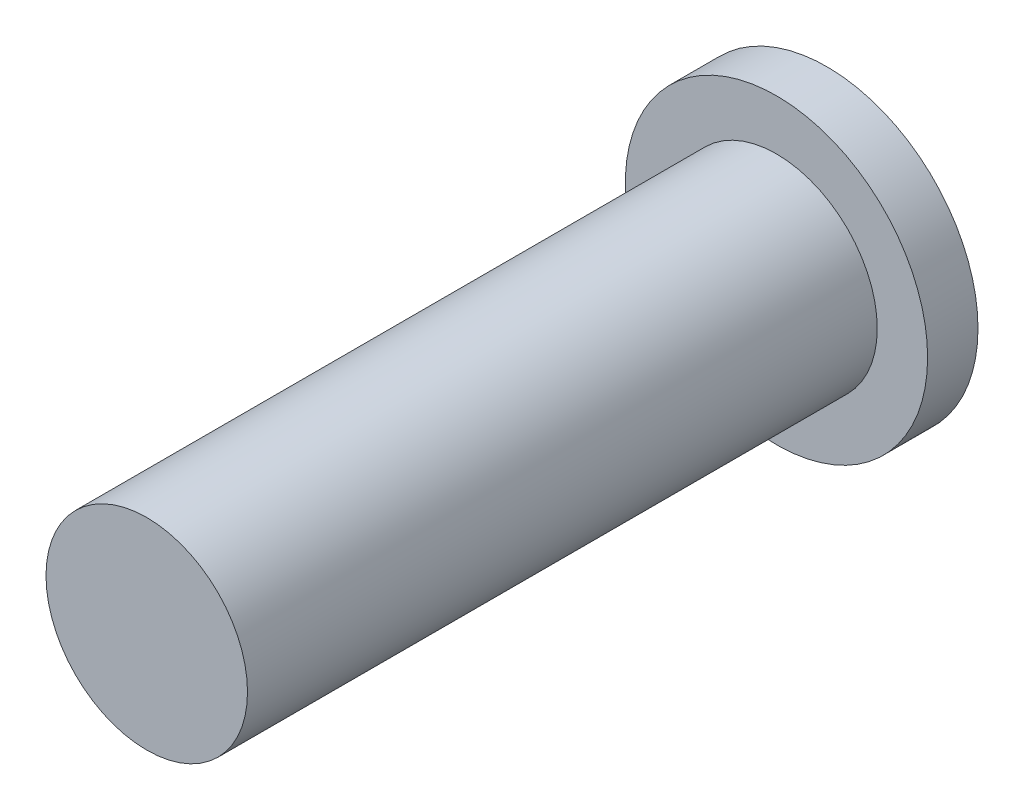
ISO-10303-21;
HEADER;
FILE_DESCRIPTION(('STEP AP214'),'2;1');
FILE_NAME('part.step','',(''),(''),'','','');
FILE_SCHEMA(('AUTOMOTIVE_DESIGN { 1 0 10303 214 1 1 1 1 }'));
ENDSEC;
DATA;
#1=APPLICATION_CONTEXT('core data for automotive mechanical design processes');
#2=APPLICATION_PROTOCOL_DEFINITION('international standard','automotive_design',2000,#1);
#3=PRODUCT_CONTEXT('',#1,'mechanical');
#4=PRODUCT('Part','Part','',(#3));
#5=PRODUCT_RELATED_PRODUCT_CATEGORY('part','',(#4));
#6=PRODUCT_DEFINITION_FORMATION('','',#4);
#7=PRODUCT_DEFINITION_CONTEXT('part definition',#1,'design');
#8=PRODUCT_DEFINITION('design','',#6,#7);
#9=PRODUCT_DEFINITION_SHAPE('','',#8);
#10=(LENGTH_UNIT() NAMED_UNIT(*) SI_UNIT(.MILLI.,.METRE.));
#11=(NAMED_UNIT(*) PLANE_ANGLE_UNIT() SI_UNIT($,.RADIAN.));
#12=(NAMED_UNIT(*) SI_UNIT($,.STERADIAN.) SOLID_ANGLE_UNIT());
#13=UNCERTAINTY_MEASURE_WITH_UNIT(LENGTH_MEASURE(1.E-05),#10,'distance_accuracy_value','');
#14=(GEOMETRIC_REPRESENTATION_CONTEXT(3) GLOBAL_UNCERTAINTY_ASSIGNED_CONTEXT((#13)) GLOBAL_UNIT_ASSIGNED_CONTEXT((#10,
#11,#12)) REPRESENTATION_CONTEXT('',''));
#15=CARTESIAN_POINT('',(0.,0.,0.));
#16=DIRECTION('',(0.,0.,1.));
#17=DIRECTION('',(1.,0.,0.));
#18=AXIS2_PLACEMENT_3D('',#15,#16,#17);
#19=CARTESIAN_POINT('',(0.,0.,2.));
#20=DIRECTION('',(0.,0.,1.));
#21=DIRECTION('',(1.,0.,0.));
#22=AXIS2_PLACEMENT_3D('',#19,#20,#21);
#23=PLANE('',#22);
#24=CARTESIAN_POINT('',(0.,0.,2.));
#25=DIRECTION('',(0.,0.,1.));
#26=DIRECTION('',(1.,0.,0.));
#27=AXIS2_PLACEMENT_3D('',#24,#25,#26);
#28=CIRCLE('',#27,6.);
#29=CARTESIAN_POINT('',(6.,0.,2.));
#30=VERTEX_POINT('',#29);
#31=EDGE_CURVE('E10',#30,#30,#28,.T.);
#32=ORIENTED_EDGE('',*,*,#31,.T.);
#33=EDGE_LOOP('',(#32));
#34=FACE_BOUND('',#33,.T.);
#35=CARTESIAN_POINT('',(0.,0.,2.));
#36=DIRECTION('',(0.,0.,1.));
#37=DIRECTION('',(1.,0.,0.));
#38=AXIS2_PLACEMENT_3D('',#35,#36,#37);
#39=CIRCLE('',#38,4.);
#40=CARTESIAN_POINT('',(4.,0.,2.));
#41=VERTEX_POINT('',#40);
#42=EDGE_CURVE('E50',#41,#41,#39,.T.);
#43=ORIENTED_EDGE('',*,*,#42,.F.);
#44=EDGE_LOOP('',(#43));
#45=FACE_BOUND('',#44,.T.);
#46=ADVANCED_FACE('F37',(#34,#45),#23,.T.);
#47=CARTESIAN_POINT('',(0.,0.,2.));
#48=DIRECTION('',(0.,0.,-1.));
#49=DIRECTION('',(-1.,0.,0.));
#50=AXIS2_PLACEMENT_3D('',#47,#48,#49);
#51=CYLINDRICAL_SURFACE('',#50,6.);
#52=ORIENTED_EDGE('',*,*,#31,.F.);
#53=EDGE_LOOP('',(#52));
#54=FACE_BOUND('',#53,.T.);
#55=CARTESIAN_POINT('',(0.,0.,0.));
#56=DIRECTION('',(0.,0.,1.));
#57=DIRECTION('',(1.,0.,0.));
#58=AXIS2_PLACEMENT_3D('',#55,#56,#57);
#59=CIRCLE('',#58,6.);
#60=CARTESIAN_POINT('',(6.,0.,0.));
#61=VERTEX_POINT('',#60);
#62=EDGE_CURVE('E41',#61,#61,#59,.T.);
#63=ORIENTED_EDGE('',*,*,#62,.T.);
#64=EDGE_LOOP('',(#63));
#65=FACE_BOUND('',#64,.T.);
#66=ADVANCED_FACE('F39',(#54,#65),#51,.T.);
#67=CARTESIAN_POINT('',(0.,0.,0.));
#68=DIRECTION('',(0.,0.,1.));
#69=DIRECTION('',(1.,0.,0.));
#70=AXIS2_PLACEMENT_3D('',#67,#68,#69);
#71=PLANE('',#70);
#72=ORIENTED_EDGE('',*,*,#62,.F.);
#73=EDGE_LOOP('',(#72));
#74=FACE_BOUND('',#73,.T.);
#75=ADVANCED_FACE('F61',(#74),#71,.F.);
#76=CARTESIAN_POINT('',(0.,0.,27.));
#77=DIRECTION('',(0.,0.,-1.));
#78=DIRECTION('',(-1.,0.,0.));
#79=AXIS2_PLACEMENT_3D('',#76,#77,#78);
#80=CYLINDRICAL_SURFACE('',#79,4.);
#81=CARTESIAN_POINT('',(0.,0.,27.));
#82=DIRECTION('',(0.,0.,1.));
#83=DIRECTION('',(1.,0.,0.));
#84=AXIS2_PLACEMENT_3D('',#81,#82,#83);
#85=CIRCLE('',#84,4.);
#86=CARTESIAN_POINT('',(4.,0.,27.));
#87=VERTEX_POINT('',#86);
#88=EDGE_CURVE('E48',#87,#87,#85,.T.);
#89=ORIENTED_EDGE('',*,*,#88,.F.);
#90=EDGE_LOOP('',(#89));
#91=FACE_BOUND('',#90,.T.);
#92=ORIENTED_EDGE('',*,*,#42,.T.);
#93=EDGE_LOOP('',(#92));
#94=FACE_BOUND('',#93,.T.);
#95=ADVANCED_FACE('F58',(#91,#94),#80,.T.);
#96=CARTESIAN_POINT('',(0.,0.,27.));
#97=DIRECTION('',(0.,0.,1.));
#98=DIRECTION('',(1.,0.,0.));
#99=AXIS2_PLACEMENT_3D('',#96,#97,#98);
#100=PLANE('',#99);
#101=ORIENTED_EDGE('',*,*,#88,.T.);
#102=EDGE_LOOP('',(#101));
#103=FACE_BOUND('',#102,.T.);
#104=ADVANCED_FACE('F56',(#103),#100,.T.);
#105=CLOSED_SHELL('',(#46,#66,#75,#95,#104));
#106=MANIFOLD_SOLID_BREP('B2',#105);
#107=ADVANCED_BREP_SHAPE_REPRESENTATION('',(#18,#106),#14);
#108=SHAPE_DEFINITION_REPRESENTATION(#9,#107);
ENDSEC;
END-ISO-10303-21;
